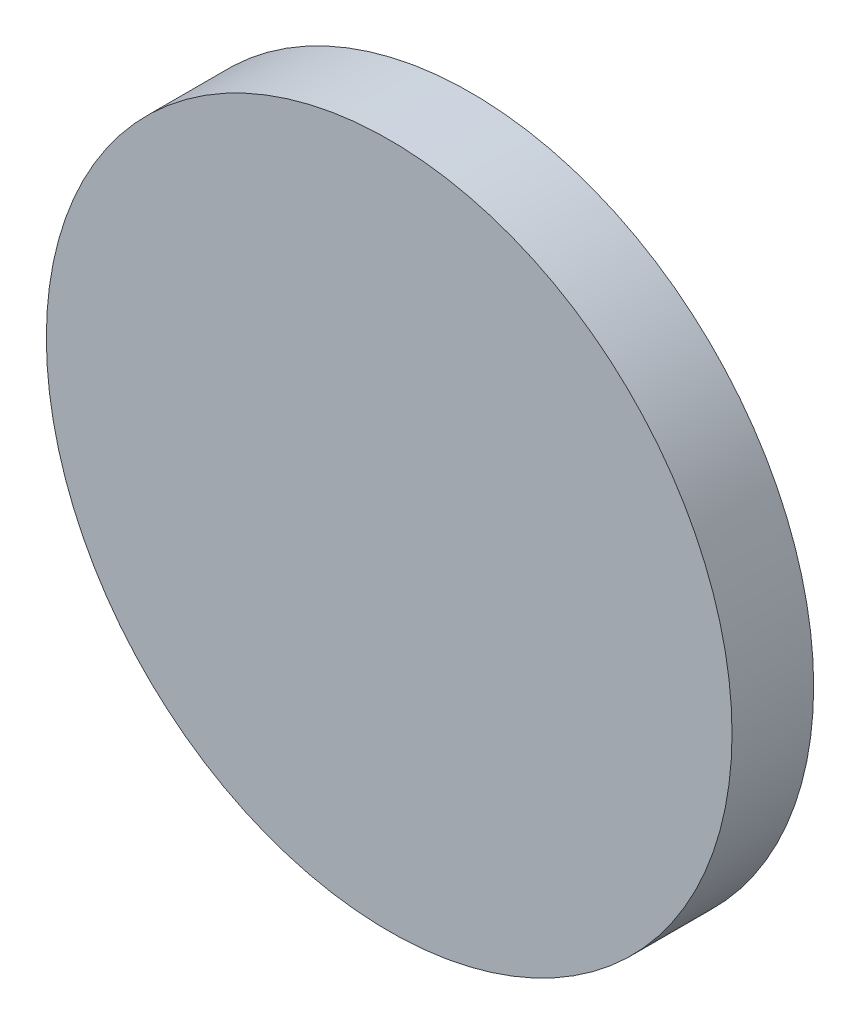
ISO-10303-21;
HEADER;
FILE_DESCRIPTION(('STEP AP214'),'2;1');
FILE_NAME('part.step','',(''),(''),'','','');
FILE_SCHEMA(('AUTOMOTIVE_DESIGN { 1 0 10303 214 1 1 1 1 }'));
ENDSEC;
DATA;
#1=APPLICATION_CONTEXT('core data for automotive mechanical design processes');
#2=APPLICATION_PROTOCOL_DEFINITION('international standard','automotive_design',2000,#1);
#3=PRODUCT_CONTEXT('',#1,'mechanical');
#4=PRODUCT('Part','Part','',(#3));
#5=PRODUCT_RELATED_PRODUCT_CATEGORY('part','',(#4));
#6=PRODUCT_DEFINITION_FORMATION('','',#4);
#7=PRODUCT_DEFINITION_CONTEXT('part definition',#1,'design');
#8=PRODUCT_DEFINITION('design','',#6,#7);
#9=PRODUCT_DEFINITION_SHAPE('','',#8);
#10=(LENGTH_UNIT() NAMED_UNIT(*) SI_UNIT(.MILLI.,.METRE.));
#11=(NAMED_UNIT(*) PLANE_ANGLE_UNIT() SI_UNIT($,.RADIAN.));
#12=(NAMED_UNIT(*) SI_UNIT($,.STERADIAN.) SOLID_ANGLE_UNIT());
#13=UNCERTAINTY_MEASURE_WITH_UNIT(LENGTH_MEASURE(1.E-05),#10,'distance_accuracy_value','');
#14=(GEOMETRIC_REPRESENTATION_CONTEXT(3) GLOBAL_UNCERTAINTY_ASSIGNED_CONTEXT((#13)) GLOBAL_UNIT_ASSIGNED_CONTEXT((#10,
#11,#12)) REPRESENTATION_CONTEXT('',''));
#15=CARTESIAN_POINT('',(0.,0.,0.));
#16=DIRECTION('',(0.,0.,1.));
#17=DIRECTION('',(1.,0.,0.));
#18=AXIS2_PLACEMENT_3D('',#15,#16,#17);
#19=CARTESIAN_POINT('',(0.,0.,0.5));
#20=DIRECTION('',(0.,0.,1.));
#21=DIRECTION('',(1.,0.,0.));
#22=AXIS2_PLACEMENT_3D('',#19,#20,#21);
#23=PLANE('',#22);
#24=CARTESIAN_POINT('',(0.,0.,0.5));
#25=DIRECTION('',(0.,0.,1.));
#26=DIRECTION('',(-1.,0.,0.));
#27=AXIS2_PLACEMENT_3D('',#24,#25,#26);
#28=CIRCLE('',#27,2.1);
#29=CARTESIAN_POINT('',(2.1,0.,0.5));
#30=VERTEX_POINT('',#29);
#31=EDGE_CURVE('E42',#30,#30,#28,.T.);
#32=ORIENTED_EDGE('',*,*,#31,.T.);
#33=EDGE_LOOP('',(#32));
#34=FACE_BOUND('',#33,.T.);
#35=ADVANCED_FACE('F16',(#34),#23,.T.);
#36=CARTESIAN_POINT('',(0.,0.,0.));
#37=DIRECTION('',(0.,0.,1.));
#38=DIRECTION('',(1.,0.,0.));
#39=AXIS2_PLACEMENT_3D('',#36,#37,#38);
#40=PLANE('',#39);
#41=CARTESIAN_POINT('',(0.,0.,0.));
#42=DIRECTION('',(0.,0.,-1.));
#43=DIRECTION('',(-1.,0.,0.));
#44=AXIS2_PLACEMENT_3D('',#41,#42,#43);
#45=CIRCLE('',#44,2.1);
#46=CARTESIAN_POINT('',(2.1,0.,0.));
#47=VERTEX_POINT('',#46);
#48=EDGE_CURVE('E10',#47,#47,#45,.T.);
#49=ORIENTED_EDGE('',*,*,#48,.T.);
#50=EDGE_LOOP('',(#49));
#51=FACE_BOUND('',#50,.T.);
#52=ADVANCED_FACE('F64',(#51),#40,.F.);
#53=CARTESIAN_POINT('',(0.,0.,0.));
#54=DIRECTION('',(0.,0.,1.));
#55=DIRECTION('',(-1.,0.,0.));
#56=AXIS2_PLACEMENT_3D('',#53,#54,#55);
#57=CYLINDRICAL_SURFACE('',#56,2.1);
#58=ORIENTED_EDGE('',*,*,#31,.F.);
#59=DIRECTION('',(0.,0.,-1.));
#60=VECTOR('',#59,1.);
#61=CARTESIAN_POINT('',(2.1,0.,0.));
#62=LINE('',#61,#60);
#63=EDGE_CURVE('E19',#30,#47,#62,.T.);
#64=ORIENTED_EDGE('',*,*,#63,.T.);
#65=ORIENTED_EDGE('',*,*,#48,.F.);
#66=ORIENTED_EDGE('',*,*,#63,.F.);
#67=EDGE_LOOP('',(#58,#64,#65,#66));
#68=FACE_BOUND('',#67,.T.);
#69=ADVANCED_FACE('F41',(#68),#57,.T.);
#70=CLOSED_SHELL('',(#35,#52,#69));
#71=MANIFOLD_SOLID_BREP('B1',#70);
#72=ADVANCED_BREP_SHAPE_REPRESENTATION('',(#18,#71),#14);
#73=SHAPE_DEFINITION_REPRESENTATION(#9,#72);
ENDSEC;
END-ISO-10303-21;
